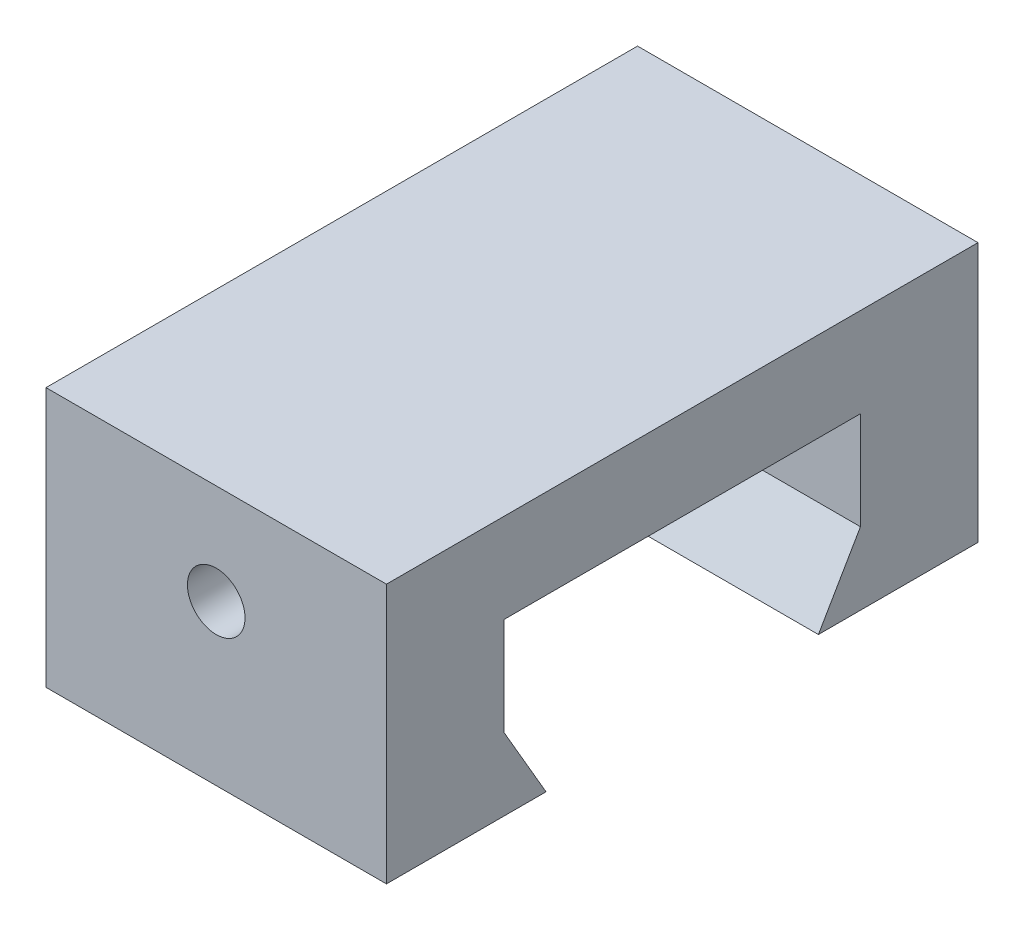
ISO-10303-21;
HEADER;
FILE_DESCRIPTION(('STEP AP214'),'2;1');
FILE_NAME('part.step','',(''),(''),'','','');
FILE_SCHEMA(('AUTOMOTIVE_DESIGN { 1 0 10303 214 1 1 1 1 }'));
ENDSEC;
DATA;
#1=APPLICATION_CONTEXT('core data for automotive mechanical design processes');
#2=APPLICATION_PROTOCOL_DEFINITION('international standard','automotive_design',2000,#1);
#3=PRODUCT_CONTEXT('',#1,'mechanical');
#4=PRODUCT('Part','Part','',(#3));
#5=PRODUCT_RELATED_PRODUCT_CATEGORY('part','',(#4));
#6=PRODUCT_DEFINITION_FORMATION('','',#4);
#7=PRODUCT_DEFINITION_CONTEXT('part definition',#1,'design');
#8=PRODUCT_DEFINITION('design','',#6,#7);
#9=PRODUCT_DEFINITION_SHAPE('','',#8);
#10=(LENGTH_UNIT() NAMED_UNIT(*) SI_UNIT(.MILLI.,.METRE.));
#11=(NAMED_UNIT(*) PLANE_ANGLE_UNIT() SI_UNIT($,.RADIAN.));
#12=(NAMED_UNIT(*) SI_UNIT($,.STERADIAN.) SOLID_ANGLE_UNIT());
#13=UNCERTAINTY_MEASURE_WITH_UNIT(LENGTH_MEASURE(1.E-05),#10,'distance_accuracy_value','');
#14=(GEOMETRIC_REPRESENTATION_CONTEXT(3) GLOBAL_UNCERTAINTY_ASSIGNED_CONTEXT((#13)) GLOBAL_UNIT_ASSIGNED_CONTEXT((#10,
#11,#12)) REPRESENTATION_CONTEXT('',''));
#15=CARTESIAN_POINT('',(0.,0.,0.));
#16=DIRECTION('',(0.,0.,1.));
#17=DIRECTION('',(1.,0.,0.));
#18=AXIS2_PLACEMENT_3D('',#15,#16,#17);
#19=CARTESIAN_POINT('',(8.,8.,8.375));
#20=DIRECTION('',(0.,1.,0.));
#21=DIRECTION('',(0.,0.,1.));
#22=AXIS2_PLACEMENT_3D('',#19,#20,#21);
#23=PLANE('',#22);
#24=DIRECTION('',(-1.,0.,0.));
#25=VECTOR('',#24,1.);
#26=CARTESIAN_POINT('',(8.,8.,-8.375));
#27=LINE('',#26,#25);
#28=CARTESIAN_POINT('',(-1.25673843837928,8.,-8.375));
#29=VERTEX_POINT('',#28);
#30=CARTESIAN_POINT('',(-8.,8.,-8.375));
#31=VERTEX_POINT('',#30);
#32=EDGE_CURVE('E182',#29,#31,#27,.T.);
#33=ORIENTED_EDGE('',*,*,#32,.F.);
#34=DIRECTION('',(0.,0.,1.));
#35=VECTOR('',#34,1.);
#36=CARTESIAN_POINT('',(-1.25673843837928,8.,13.9));
#37=LINE('',#36,#35);
#38=CARTESIAN_POINT('',(-1.25673843837928,8.,8.375));
#39=VERTEX_POINT('',#38);
#40=EDGE_CURVE('E11',#29,#39,#37,.T.);
#41=ORIENTED_EDGE('',*,*,#40,.T.);
#42=DIRECTION('',(-1.,0.,0.));
#43=VECTOR('',#42,1.);
#44=CARTESIAN_POINT('',(8.,8.,8.375));
#45=LINE('',#44,#43);
#46=CARTESIAN_POINT('',(-8.,8.,8.375));
#47=VERTEX_POINT('',#46);
#48=EDGE_CURVE('E186',#39,#47,#45,.T.);
#49=ORIENTED_EDGE('',*,*,#48,.T.);
#50=DIRECTION('',(0.,0.,-1.));
#51=VECTOR('',#50,1.);
#52=CARTESIAN_POINT('',(-8.,8.,8.375));
#53=LINE('',#52,#51);
#54=EDGE_CURVE('E164',#47,#31,#53,.T.);
#55=ORIENTED_EDGE('',*,*,#54,.T.);
#56=EDGE_LOOP('',(#33,#41,#49,#55));
#57=FACE_BOUND('',#56,.T.);
#58=ADVANCED_FACE('F33',(#57),#23,.F.);
#59=CARTESIAN_POINT('',(8.,0.,13.9));
#60=DIRECTION('',(0.,0.,-1.));
#61=DIRECTION('',(0.,1.,0.));
#62=AXIS2_PLACEMENT_3D('',#59,#60,#61);
#63=PLANE('',#62);
#64=CARTESIAN_POINT('',(0.,7.5,13.9));
#65=DIRECTION('',(0.,0.,1.));
#66=DIRECTION('',(1.,0.,0.));
#67=AXIS2_PLACEMENT_3D('',#64,#65,#66);
#68=CIRCLE('',#67,1.35255);
#69=CARTESIAN_POINT('',(1.35255,7.5,13.9));
#70=VERTEX_POINT('',#69);
#71=EDGE_CURVE('E227',#70,#70,#68,.T.);
#72=ORIENTED_EDGE('',*,*,#71,.F.);
#73=EDGE_LOOP('',(#72));
#74=FACE_BOUND('',#73,.T.);
#75=DIRECTION('',(0.,-1.,0.));
#76=VECTOR('',#75,1.);
#77=CARTESIAN_POINT('',(-8.,0.,13.9));
#78=LINE('',#77,#76);
#79=CARTESIAN_POINT('',(-8.,12.2,13.9));
#80=VERTEX_POINT('',#79);
#81=CARTESIAN_POINT('',(-8.,0.,13.9));
#82=VERTEX_POINT('',#81);
#83=EDGE_CURVE('E154',#80,#82,#78,.T.);
#84=ORIENTED_EDGE('',*,*,#83,.T.);
#85=DIRECTION('',(-1.,0.,0.));
#86=VECTOR('',#85,1.);
#87=CARTESIAN_POINT('',(8.,0.,13.9));
#88=LINE('',#87,#86);
#89=CARTESIAN_POINT('',(8.,0.,13.9));
#90=VERTEX_POINT('',#89);
#91=EDGE_CURVE('E196',#90,#82,#88,.T.);
#92=ORIENTED_EDGE('',*,*,#91,.F.);
#93=DIRECTION('',(0.,-1.,0.));
#94=VECTOR('',#93,1.);
#95=CARTESIAN_POINT('',(8.,0.,13.9));
#96=LINE('',#95,#94);
#97=CARTESIAN_POINT('',(8.,12.2,13.9));
#98=VERTEX_POINT('',#97);
#99=EDGE_CURVE('E175',#98,#90,#96,.T.);
#100=ORIENTED_EDGE('',*,*,#99,.F.);
#101=DIRECTION('',(-1.,0.,0.));
#102=VECTOR('',#101,1.);
#103=CARTESIAN_POINT('',(8.,12.2,13.9));
#104=LINE('',#103,#102);
#105=EDGE_CURVE('E150',#98,#80,#104,.T.);
#106=ORIENTED_EDGE('',*,*,#105,.T.);
#107=EDGE_LOOP('',(#84,#92,#100,#106));
#108=FACE_BOUND('',#107,.T.);
#109=ADVANCED_FACE('F35',(#74,#108),#63,.F.);
#110=CARTESIAN_POINT('',(8.,0.,13.9));
#111=DIRECTION('',(0.,1.,0.));
#112=DIRECTION('',(0.,0.,1.));
#113=AXIS2_PLACEMENT_3D('',#110,#111,#112);
#114=PLANE('',#113);
#115=DIRECTION('',(0.,0.,-1.));
#116=VECTOR('',#115,1.);
#117=CARTESIAN_POINT('',(-8.,0.,13.9));
#118=LINE('',#117,#116);
#119=CARTESIAN_POINT('',(-8.,0.,6.4));
#120=VERTEX_POINT('',#119);
#121=EDGE_CURVE('E157',#82,#120,#118,.T.);
#122=ORIENTED_EDGE('',*,*,#121,.T.);
#123=DIRECTION('',(-1.,0.,0.));
#124=VECTOR('',#123,1.);
#125=CARTESIAN_POINT('',(8.,0.,6.4));
#126=LINE('',#125,#124);
#127=CARTESIAN_POINT('',(8.,0.,6.4));
#128=VERTEX_POINT('',#127);
#129=EDGE_CURVE('E193',#128,#120,#126,.T.);
#130=ORIENTED_EDGE('',*,*,#129,.F.);
#131=DIRECTION('',(0.,0.,-1.));
#132=VECTOR('',#131,1.);
#133=CARTESIAN_POINT('',(8.,0.,13.9));
#134=LINE('',#133,#132);
#135=EDGE_CURVE('E105',#90,#128,#134,.T.);
#136=ORIENTED_EDGE('',*,*,#135,.F.);
#137=ORIENTED_EDGE('',*,*,#91,.T.);
#138=EDGE_LOOP('',(#122,#130,#136,#137));
#139=FACE_BOUND('',#138,.T.);
#140=ADVANCED_FACE('F235',(#139),#114,.F.);
#141=CARTESIAN_POINT('',(8.,0.,6.4));
#142=DIRECTION('',(0.,-0.502288895251289,0.864699870306016));
#143=DIRECTION('',(0.,-0.864699870306016,-0.502288895251289));
#144=AXIS2_PLACEMENT_3D('',#141,#142,#143);
#145=PLANE('',#144);
#146=DIRECTION('',(0.,0.864699870306015,0.502288895251289));
#147=VECTOR('',#146,1.);
#148=CARTESIAN_POINT('',(-8.,0.,6.4));
#149=LINE('',#148,#147);
#150=CARTESIAN_POINT('',(-8.,3.4,8.375));
#151=VERTEX_POINT('',#150);
#152=EDGE_CURVE('E159',#120,#151,#149,.T.);
#153=ORIENTED_EDGE('',*,*,#152,.T.);
#154=DIRECTION('',(-1.,0.,0.));
#155=VECTOR('',#154,1.);
#156=CARTESIAN_POINT('',(8.,3.4,8.375));
#157=LINE('',#156,#155);
#158=CARTESIAN_POINT('',(8.,3.4,8.375));
#159=VERTEX_POINT('',#158);
#160=EDGE_CURVE('E190',#159,#151,#157,.T.);
#161=ORIENTED_EDGE('',*,*,#160,.F.);
#162=DIRECTION('',(0.,0.864699870306015,0.502288895251289));
#163=VECTOR('',#162,1.);
#164=CARTESIAN_POINT('',(8.,0.,6.4));
#165=LINE('',#164,#163);
#166=EDGE_CURVE('E217',#128,#159,#165,.T.);
#167=ORIENTED_EDGE('',*,*,#166,.F.);
#168=ORIENTED_EDGE('',*,*,#129,.T.);
#169=EDGE_LOOP('',(#153,#161,#167,#168));
#170=FACE_BOUND('',#169,.T.);
#171=ADVANCED_FACE('F244',(#170),#145,.F.);
#172=CARTESIAN_POINT('',(8.,3.4,8.375));
#173=DIRECTION('',(0.,0.,1.));
#174=DIRECTION('',(1.,0.,0.));
#175=AXIS2_PLACEMENT_3D('',#172,#173,#174);
#176=PLANE('',#175);
#177=ORIENTED_EDGE('',*,*,#48,.F.);
#178=CARTESIAN_POINT('',(0.,7.5,8.375));
#179=DIRECTION('',(0.,0.,1.));
#180=DIRECTION('',(1.,0.,0.));
#181=AXIS2_PLACEMENT_3D('',#178,#179,#180);
#182=CIRCLE('',#181,1.35255);
#183=CARTESIAN_POINT('',(1.25673843837928,8.,8.375));
#184=VERTEX_POINT('',#183);
#185=EDGE_CURVE('E222',#39,#184,#182,.T.);
#186=ORIENTED_EDGE('',*,*,#185,.T.);
#187=CARTESIAN_POINT('',(8.,8.,8.375));
#188=VERTEX_POINT('',#187);
#189=EDGE_CURVE('E187',#188,#184,#45,.T.);
#190=ORIENTED_EDGE('',*,*,#189,.F.);
#191=DIRECTION('',(0.,1.,0.));
#192=VECTOR('',#191,1.);
#193=CARTESIAN_POINT('',(8.,3.4,8.375));
#194=LINE('',#193,#192);
#195=EDGE_CURVE('E213',#159,#188,#194,.T.);
#196=ORIENTED_EDGE('',*,*,#195,.F.);
#197=ORIENTED_EDGE('',*,*,#160,.T.);
#198=DIRECTION('',(0.,1.,0.));
#199=VECTOR('',#198,1.);
#200=CARTESIAN_POINT('',(-8.,3.4,8.375));
#201=LINE('',#200,#199);
#202=EDGE_CURVE('E161',#151,#47,#201,.T.);
#203=ORIENTED_EDGE('',*,*,#202,.T.);
#204=EDGE_LOOP('',(#177,#186,#190,#196,#197,#203));
#205=FACE_BOUND('',#204,.T.);
#206=ADVANCED_FACE('F248',(#205),#176,.F.);
#207=ORIENTED_EDGE('',*,*,#189,.T.);
#208=DIRECTION('',(0.,0.,1.));
#209=VECTOR('',#208,1.);
#210=CARTESIAN_POINT('',(1.25673843837928,8.,13.9));
#211=LINE('',#210,#209);
#212=CARTESIAN_POINT('',(1.25673843837928,8.,-8.375));
#213=VERTEX_POINT('',#212);
#214=EDGE_CURVE('E41',#184,#213,#211,.F.);
#215=ORIENTED_EDGE('',*,*,#214,.T.);
#216=CARTESIAN_POINT('',(8.,8.,-8.375));
#217=VERTEX_POINT('',#216);
#218=EDGE_CURVE('E183',#217,#213,#27,.T.);
#219=ORIENTED_EDGE('',*,*,#218,.F.);
#220=DIRECTION('',(0.,0.,-1.));
#221=VECTOR('',#220,1.);
#222=CARTESIAN_POINT('',(8.,8.,8.375));
#223=LINE('',#222,#221);
#224=EDGE_CURVE('E211',#188,#217,#223,.T.);
#225=ORIENTED_EDGE('',*,*,#224,.F.);
#226=EDGE_LOOP('',(#207,#215,#219,#225));
#227=FACE_BOUND('',#226,.T.);
#228=ADVANCED_FACE('F199',(#227),#23,.F.);
#229=CARTESIAN_POINT('',(8.,8.,-8.375));
#230=DIRECTION('',(0.,0.,-1.));
#231=DIRECTION('',(-1.,0.,0.));
#232=AXIS2_PLACEMENT_3D('',#229,#230,#231);
#233=PLANE('',#232);
#234=ORIENTED_EDGE('',*,*,#218,.T.);
#235=CARTESIAN_POINT('',(0.,7.5,-8.375));
#236=DIRECTION('',(0.,0.,-1.));
#237=DIRECTION('',(-1.,0.,0.));
#238=AXIS2_PLACEMENT_3D('',#235,#236,#237);
#239=CIRCLE('',#238,1.35255);
#240=EDGE_CURVE('E48',#213,#29,#239,.T.);
#241=ORIENTED_EDGE('',*,*,#240,.T.);
#242=ORIENTED_EDGE('',*,*,#32,.T.);
#243=DIRECTION('',(0.,-1.,0.));
#244=VECTOR('',#243,1.);
#245=CARTESIAN_POINT('',(-8.,8.,-8.375));
#246=LINE('',#245,#244);
#247=CARTESIAN_POINT('',(-8.,3.4,-8.375));
#248=VERTEX_POINT('',#247);
#249=EDGE_CURVE('E167',#31,#248,#246,.T.);
#250=ORIENTED_EDGE('',*,*,#249,.T.);
#251=DIRECTION('',(-1.,0.,0.));
#252=VECTOR('',#251,1.);
#253=CARTESIAN_POINT('',(8.,3.4,-8.375));
#254=LINE('',#253,#252);
#255=CARTESIAN_POINT('',(8.,3.4,-8.375));
#256=VERTEX_POINT('',#255);
#257=EDGE_CURVE('E179',#256,#248,#254,.T.);
#258=ORIENTED_EDGE('',*,*,#257,.F.);
#259=DIRECTION('',(0.,-1.,0.));
#260=VECTOR('',#259,1.);
#261=CARTESIAN_POINT('',(8.,8.,-8.375));
#262=LINE('',#261,#260);
#263=EDGE_CURVE('E210',#217,#256,#262,.T.);
#264=ORIENTED_EDGE('',*,*,#263,.F.);
#265=EDGE_LOOP('',(#234,#241,#242,#250,#258,#264));
#266=FACE_BOUND('',#265,.T.);
#267=ADVANCED_FACE('F207',(#266),#233,.F.);
#268=CARTESIAN_POINT('',(8.,3.4,-8.375));
#269=DIRECTION('',(0.,-0.502288895251289,-0.864699870306016));
#270=DIRECTION('',(0.,0.864699870306016,-0.502288895251289));
#271=AXIS2_PLACEMENT_3D('',#268,#269,#270);
#272=PLANE('',#271);
#273=DIRECTION('',(0.,-0.864699870306015,0.502288895251289));
#274=VECTOR('',#273,1.);
#275=CARTESIAN_POINT('',(-8.,3.4,-8.375));
#276=LINE('',#275,#274);
#277=CARTESIAN_POINT('',(-8.,0.,-6.4));
#278=VERTEX_POINT('',#277);
#279=EDGE_CURVE('E169',#248,#278,#276,.T.);
#280=ORIENTED_EDGE('',*,*,#279,.T.);
#281=DIRECTION('',(-1.,0.,0.));
#282=VECTOR('',#281,1.);
#283=CARTESIAN_POINT('',(8.,0.,-6.4));
#284=LINE('',#283,#282);
#285=CARTESIAN_POINT('',(8.,0.,-6.4));
#286=VERTEX_POINT('',#285);
#287=EDGE_CURVE('E145',#286,#278,#284,.T.);
#288=ORIENTED_EDGE('',*,*,#287,.F.);
#289=DIRECTION('',(0.,-0.864699870306015,0.502288895251289));
#290=VECTOR('',#289,1.);
#291=CARTESIAN_POINT('',(8.,3.4,-8.375));
#292=LINE('',#291,#290);
#293=EDGE_CURVE('E133',#256,#286,#292,.T.);
#294=ORIENTED_EDGE('',*,*,#293,.F.);
#295=ORIENTED_EDGE('',*,*,#257,.T.);
#296=EDGE_LOOP('',(#280,#288,#294,#295));
#297=FACE_BOUND('',#296,.T.);
#298=ADVANCED_FACE('F263',(#297),#272,.F.);
#299=CARTESIAN_POINT('',(8.,0.,-6.4));
#300=DIRECTION('',(0.,1.,0.));
#301=DIRECTION('',(0.,0.,1.));
#302=AXIS2_PLACEMENT_3D('',#299,#300,#301);
#303=PLANE('',#302);
#304=DIRECTION('',(0.,0.,-1.));
#305=VECTOR('',#304,1.);
#306=CARTESIAN_POINT('',(-8.,0.,-6.4));
#307=LINE('',#306,#305);
#308=CARTESIAN_POINT('',(-8.,0.,-13.9));
#309=VERTEX_POINT('',#308);
#310=EDGE_CURVE('E142',#278,#309,#307,.T.);
#311=ORIENTED_EDGE('',*,*,#310,.T.);
#312=DIRECTION('',(-1.,0.,0.));
#313=VECTOR('',#312,1.);
#314=CARTESIAN_POINT('',(8.,0.,-13.9));
#315=LINE('',#314,#313);
#316=CARTESIAN_POINT('',(8.,0.,-13.9));
#317=VERTEX_POINT('',#316);
#318=EDGE_CURVE('E139',#317,#309,#315,.T.);
#319=ORIENTED_EDGE('',*,*,#318,.F.);
#320=DIRECTION('',(0.,0.,-1.));
#321=VECTOR('',#320,1.);
#322=CARTESIAN_POINT('',(8.,0.,-6.4));
#323=LINE('',#322,#321);
#324=EDGE_CURVE('E126',#286,#317,#323,.T.);
#325=ORIENTED_EDGE('',*,*,#324,.F.);
#326=ORIENTED_EDGE('',*,*,#287,.T.);
#327=EDGE_LOOP('',(#311,#319,#325,#326));
#328=FACE_BOUND('',#327,.T.);
#329=ADVANCED_FACE('F140',(#328),#303,.F.);
#330=CARTESIAN_POINT('',(8.,0.,-13.9));
#331=DIRECTION('',(0.,0.,1.));
#332=DIRECTION('',(0.,-1.,0.));
#333=AXIS2_PLACEMENT_3D('',#330,#331,#332);
#334=PLANE('',#333);
#335=CARTESIAN_POINT('',(0.,7.5,-13.9));
#336=DIRECTION('',(0.,0.,1.));
#337=DIRECTION('',(1.,0.,0.));
#338=AXIS2_PLACEMENT_3D('',#335,#336,#337);
#339=CIRCLE('',#338,1.35255);
#340=CARTESIAN_POINT('',(1.35255,7.5,-13.9));
#341=VERTEX_POINT('',#340);
#342=EDGE_CURVE('E224',#341,#341,#339,.T.);
#343=ORIENTED_EDGE('',*,*,#342,.T.);
#344=EDGE_LOOP('',(#343));
#345=FACE_BOUND('',#344,.T.);
#346=DIRECTION('',(0.,1.,0.));
#347=VECTOR('',#346,1.);
#348=CARTESIAN_POINT('',(-8.,0.,-13.9));
#349=LINE('',#348,#347);
#350=CARTESIAN_POINT('',(-8.,12.2,-13.9));
#351=VERTEX_POINT('',#350);
#352=EDGE_CURVE('E172',#309,#351,#349,.T.);
#353=ORIENTED_EDGE('',*,*,#352,.T.);
#354=DIRECTION('',(-1.,0.,0.));
#355=VECTOR('',#354,1.);
#356=CARTESIAN_POINT('',(8.,12.2,-13.9));
#357=LINE('',#356,#355);
#358=CARTESIAN_POINT('',(8.,12.2,-13.9));
#359=VERTEX_POINT('',#358);
#360=EDGE_CURVE('E146',#359,#351,#357,.T.);
#361=ORIENTED_EDGE('',*,*,#360,.F.);
#362=DIRECTION('',(0.,1.,0.));
#363=VECTOR('',#362,1.);
#364=CARTESIAN_POINT('',(8.,0.,-13.9));
#365=LINE('',#364,#363);
#366=EDGE_CURVE('E130',#317,#359,#365,.T.);
#367=ORIENTED_EDGE('',*,*,#366,.F.);
#368=ORIENTED_EDGE('',*,*,#318,.T.);
#369=EDGE_LOOP('',(#353,#361,#367,#368));
#370=FACE_BOUND('',#369,.T.);
#371=ADVANCED_FACE('F148',(#345,#370),#334,.F.);
#372=CARTESIAN_POINT('',(8.,12.2,13.9));
#373=DIRECTION('',(0.,-1.,0.));
#374=DIRECTION('',(0.,0.,-1.));
#375=AXIS2_PLACEMENT_3D('',#372,#373,#374);
#376=PLANE('',#375);
#377=DIRECTION('',(0.,0.,1.));
#378=VECTOR('',#377,1.);
#379=CARTESIAN_POINT('',(-8.,12.2,13.9));
#380=LINE('',#379,#378);
#381=EDGE_CURVE('E96',#351,#80,#380,.T.);
#382=ORIENTED_EDGE('',*,*,#381,.T.);
#383=ORIENTED_EDGE('',*,*,#105,.F.);
#384=DIRECTION('',(0.,0.,1.));
#385=VECTOR('',#384,1.);
#386=CARTESIAN_POINT('',(8.,12.2,13.9));
#387=LINE('',#386,#385);
#388=EDGE_CURVE('E57',#359,#98,#387,.T.);
#389=ORIENTED_EDGE('',*,*,#388,.F.);
#390=ORIENTED_EDGE('',*,*,#360,.T.);
#391=EDGE_LOOP('',(#382,#383,#389,#390));
#392=FACE_BOUND('',#391,.T.);
#393=ADVANCED_FACE('F281',(#392),#376,.F.);
#394=CARTESIAN_POINT('',(8.,0.,0.));
#395=DIRECTION('',(-1.,0.,0.));
#396=DIRECTION('',(0.,0.,1.));
#397=AXIS2_PLACEMENT_3D('',#394,#395,#396);
#398=PLANE('',#397);
#399=ORIENTED_EDGE('',*,*,#99,.T.);
#400=ORIENTED_EDGE('',*,*,#135,.T.);
#401=ORIENTED_EDGE('',*,*,#166,.T.);
#402=ORIENTED_EDGE('',*,*,#195,.T.);
#403=ORIENTED_EDGE('',*,*,#224,.T.);
#404=ORIENTED_EDGE('',*,*,#263,.T.);
#405=ORIENTED_EDGE('',*,*,#293,.T.);
#406=ORIENTED_EDGE('',*,*,#324,.T.);
#407=ORIENTED_EDGE('',*,*,#366,.T.);
#408=ORIENTED_EDGE('',*,*,#388,.T.);
#409=EDGE_LOOP('',(#399,#400,#401,#402,#403,#404,#405,#406,#407,#408));
#410=FACE_BOUND('',#409,.T.);
#411=ADVANCED_FACE('F128',(#410),#398,.F.);
#412=CARTESIAN_POINT('',(-8.,0.,0.));
#413=DIRECTION('',(-1.,0.,0.));
#414=DIRECTION('',(0.,0.,1.));
#415=AXIS2_PLACEMENT_3D('',#412,#413,#414);
#416=PLANE('',#415);
#417=ORIENTED_EDGE('',*,*,#83,.F.);
#418=ORIENTED_EDGE('',*,*,#381,.F.);
#419=ORIENTED_EDGE('',*,*,#352,.F.);
#420=ORIENTED_EDGE('',*,*,#310,.F.);
#421=ORIENTED_EDGE('',*,*,#279,.F.);
#422=ORIENTED_EDGE('',*,*,#249,.F.);
#423=ORIENTED_EDGE('',*,*,#54,.F.);
#424=ORIENTED_EDGE('',*,*,#202,.F.);
#425=ORIENTED_EDGE('',*,*,#152,.F.);
#426=ORIENTED_EDGE('',*,*,#121,.F.);
#427=EDGE_LOOP('',(#417,#418,#419,#420,#421,#422,#423,#424,#425,#426));
#428=FACE_BOUND('',#427,.T.);
#429=ADVANCED_FACE('F240',(#428),#416,.T.);
#430=CARTESIAN_POINT('',(0.,7.5,13.9));
#431=DIRECTION('',(0.,0.,1.));
#432=DIRECTION('',(1.,0.,0.));
#433=AXIS2_PLACEMENT_3D('',#430,#431,#432);
#434=CYLINDRICAL_SURFACE('',#433,1.35255);
#435=ORIENTED_EDGE('',*,*,#342,.F.);
#436=EDGE_LOOP('',(#435));
#437=FACE_BOUND('',#436,.T.);
#438=ORIENTED_EDGE('',*,*,#71,.T.);
#439=EDGE_LOOP('',(#438));
#440=FACE_BOUND('',#439,.T.);
#441=ORIENTED_EDGE('',*,*,#240,.F.);
#442=ORIENTED_EDGE('',*,*,#214,.F.);
#443=ORIENTED_EDGE('',*,*,#185,.F.);
#444=ORIENTED_EDGE('',*,*,#40,.F.);
#445=EDGE_LOOP('',(#441,#442,#443,#444));
#446=FACE_BOUND('',#445,.T.);
#447=ADVANCED_FACE('F231',(#437,#440,#446),#434,.F.);
#448=CLOSED_SHELL('',(#58,#109,#140,#171,#206,#228,#267,#298,#329,#371,#393,#411,#429,#447));
#449=MANIFOLD_SOLID_BREP('B2',#448);
#450=ADVANCED_BREP_SHAPE_REPRESENTATION('',(#18,#449),#14);
#451=SHAPE_DEFINITION_REPRESENTATION(#9,#450);
ENDSEC;
END-ISO-10303-21;
